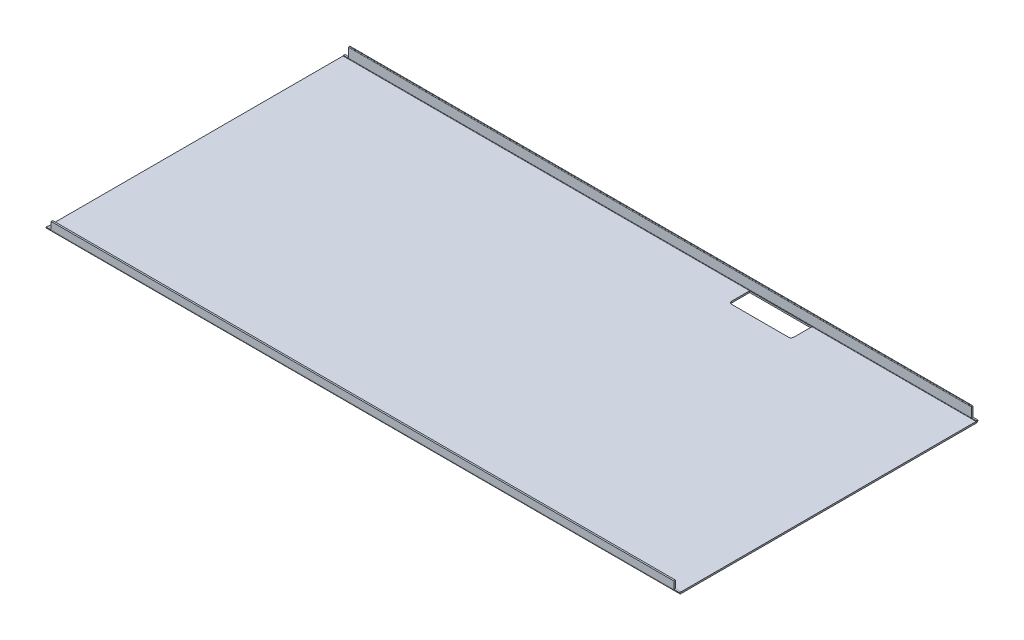
ISO-10303-21;
HEADER;
FILE_DESCRIPTION(('STEP AP214'),'2;1');
FILE_NAME('part.step','',(''),(''),'','','');
FILE_SCHEMA(('AUTOMOTIVE_DESIGN { 1 0 10303 214 1 1 1 1 }'));
ENDSEC;
DATA;
#1=APPLICATION_CONTEXT('core data for automotive mechanical design processes');
#2=APPLICATION_PROTOCOL_DEFINITION('international standard','automotive_design',2000,#1);
#3=PRODUCT_CONTEXT('',#1,'mechanical');
#4=PRODUCT('Part','Part','',(#3));
#5=PRODUCT_RELATED_PRODUCT_CATEGORY('part','',(#4));
#6=PRODUCT_DEFINITION_FORMATION('','',#4);
#7=PRODUCT_DEFINITION_CONTEXT('part definition',#1,'design');
#8=PRODUCT_DEFINITION('design','',#6,#7);
#9=PRODUCT_DEFINITION_SHAPE('','',#8);
#10=(LENGTH_UNIT() NAMED_UNIT(*) SI_UNIT(.MILLI.,.METRE.));
#11=(NAMED_UNIT(*) PLANE_ANGLE_UNIT() SI_UNIT($,.RADIAN.));
#12=(NAMED_UNIT(*) SI_UNIT($,.STERADIAN.) SOLID_ANGLE_UNIT());
#13=UNCERTAINTY_MEASURE_WITH_UNIT(LENGTH_MEASURE(1.E-05),#10,'distance_accuracy_value','');
#14=(GEOMETRIC_REPRESENTATION_CONTEXT(3) GLOBAL_UNCERTAINTY_ASSIGNED_CONTEXT((#13)) GLOBAL_UNIT_ASSIGNED_CONTEXT((#10,
#11,#12)) REPRESENTATION_CONTEXT('',''));
#15=CARTESIAN_POINT('',(0.,0.,0.));
#16=DIRECTION('',(0.,0.,1.));
#17=DIRECTION('',(1.,0.,0.));
#18=AXIS2_PLACEMENT_3D('',#15,#16,#17);
#19=CARTESIAN_POINT('',(1220.,-14.0410958904109,128.030523287671));
#20=DIRECTION('',(1.,0.,0.));
#21=DIRECTION('',(0.,0.,-1.));
#22=AXIS2_PLACEMENT_3D('',#19,#20,#21);
#23=PLANE('',#22);
#24=DIRECTION('',(0.,-1.,0.));
#25=VECTOR('',#24,1.);
#26=CARTESIAN_POINT('',(1220.,-14.0410958904109,128.030523287671));
#27=LINE('',#26,#25);
#28=CARTESIAN_POINT('',(1220.,-14.0410958904109,128.030523287671));
#29=VERTEX_POINT('',#28);
#30=CARTESIAN_POINT('',(1220.,-17.041095890411,128.030523287671));
#31=VERTEX_POINT('',#30);
#32=EDGE_CURVE('E290',#29,#31,#27,.T.);
#33=ORIENTED_EDGE('',*,*,#32,.F.);
#34=CARTESIAN_POINT('',(1220.,-13.3044958904109,128.030523287671));
#35=DIRECTION('',(-1.,0.,0.));
#36=DIRECTION('',(0.,0.,1.));
#37=AXIS2_PLACEMENT_3D('',#34,#35,#36);
#38=CIRCLE('',#37,0.7366);
#39=CARTESIAN_POINT('',(1220.,-13.3044958904109,128.767123287671));
#40=VERTEX_POINT('',#39);
#41=EDGE_CURVE('E373',#40,#29,#38,.F.);
#42=ORIENTED_EDGE('',*,*,#41,.F.);
#43=DIRECTION('',(0.,0.,-1.));
#44=VECTOR('',#43,1.);
#45=CARTESIAN_POINT('',(1220.,-13.3044958904109,131.767123287671));
#46=LINE('',#45,#44);
#47=CARTESIAN_POINT('',(1220.,-13.3044958904109,131.767123287671));
#48=VERTEX_POINT('',#47);
#49=EDGE_CURVE('E288',#48,#40,#46,.T.);
#50=ORIENTED_EDGE('',*,*,#49,.F.);
#51=CARTESIAN_POINT('',(1220.,-13.3044958904109,128.030523287671));
#52=DIRECTION('',(1.,0.,0.));
#53=DIRECTION('',(0.,0.,-1.));
#54=AXIS2_PLACEMENT_3D('',#51,#52,#53);
#55=CIRCLE('',#54,3.7366);
#56=EDGE_CURVE('E376',#48,#31,#55,.T.);
#57=ORIENTED_EDGE('',*,*,#56,.T.);
#58=EDGE_LOOP('',(#33,#42,#50,#57));
#59=FACE_BOUND('',#58,.T.);
#60=ADVANCED_FACE('F41',(#59),#23,.T.);
#61=CARTESIAN_POINT('',(1220.,-13.3044958904109,131.767123287671));
#62=DIRECTION('',(1.,0.,0.));
#63=DIRECTION('',(0.,0.,-1.));
#64=AXIS2_PLACEMENT_3D('',#61,#62,#63);
#65=PLANE('',#64);
#66=DIRECTION('',(0.,0.,-1.));
#67=VECTOR('',#66,1.);
#68=CARTESIAN_POINT('',(1220.,-14.0410958904109,128.767123287671));
#69=LINE('',#68,#67);
#70=CARTESIAN_POINT('',(1220.,-14.0410958904109,-440.496276712329));
#71=VERTEX_POINT('',#70);
#72=EDGE_CURVE('E369',#29,#71,#69,.T.);
#73=ORIENTED_EDGE('',*,*,#72,.F.);
#74=ORIENTED_EDGE('',*,*,#32,.T.);
#75=DIRECTION('',(0.,0.,-1.));
#76=VECTOR('',#75,1.);
#77=CARTESIAN_POINT('',(1220.,-17.041095890411,128.767123287671));
#78=LINE('',#77,#76);
#79=CARTESIAN_POINT('',(1220.,-17.041095890411,-440.496276712329));
#80=VERTEX_POINT('',#79);
#81=EDGE_CURVE('E379',#31,#80,#78,.T.);
#82=ORIENTED_EDGE('',*,*,#81,.T.);
#83=DIRECTION('',(0.,1.,0.));
#84=VECTOR('',#83,1.);
#85=CARTESIAN_POINT('',(1220.,-17.041095890411,-440.496276712329));
#86=LINE('',#85,#84);
#87=EDGE_CURVE('E280',#80,#71,#86,.T.);
#88=ORIENTED_EDGE('',*,*,#87,.T.);
#89=EDGE_LOOP('',(#73,#74,#82,#88));
#90=FACE_BOUND('',#89,.T.);
#91=ADVANCED_FACE('F487',(#90),#65,.T.);
#92=CARTESIAN_POINT('',(0.,-13.3044958904109,128.767123287671));
#93=DIRECTION('',(-1.,0.,0.));
#94=DIRECTION('',(0.,0.,1.));
#95=AXIS2_PLACEMENT_3D('',#92,#93,#94);
#96=PLANE('',#95);
#97=DIRECTION('',(0.,0.,1.));
#98=VECTOR('',#97,1.);
#99=CARTESIAN_POINT('',(0.,-13.3044958904109,128.767123287671));
#100=LINE('',#99,#98);
#101=CARTESIAN_POINT('',(0.,-13.3044958904109,128.767123287671));
#102=VERTEX_POINT('',#101);
#103=CARTESIAN_POINT('',(0.,-13.3044958904109,131.767123287671));
#104=VERTEX_POINT('',#103);
#105=EDGE_CURVE('E286',#102,#104,#100,.T.);
#106=ORIENTED_EDGE('',*,*,#105,.F.);
#107=CARTESIAN_POINT('',(0.,-13.3044958904109,128.030523287671));
#108=DIRECTION('',(-1.,0.,0.));
#109=DIRECTION('',(0.,0.,1.));
#110=AXIS2_PLACEMENT_3D('',#107,#108,#109);
#111=CIRCLE('',#110,0.7366);
#112=CARTESIAN_POINT('',(0.,-14.0410958904109,128.030523287671));
#113=VERTEX_POINT('',#112);
#114=EDGE_CURVE('E389',#102,#113,#111,.F.);
#115=ORIENTED_EDGE('',*,*,#114,.T.);
#116=DIRECTION('',(0.,1.,0.));
#117=VECTOR('',#116,1.);
#118=CARTESIAN_POINT('',(0.,-17.041095890411,128.030523287671));
#119=LINE('',#118,#117);
#120=CARTESIAN_POINT('',(0.,-17.041095890411,128.030523287671));
#121=VERTEX_POINT('',#120);
#122=EDGE_CURVE('E284',#121,#113,#119,.T.);
#123=ORIENTED_EDGE('',*,*,#122,.F.);
#124=CARTESIAN_POINT('',(0.,-13.3044958904109,128.030523287671));
#125=DIRECTION('',(1.,0.,0.));
#126=DIRECTION('',(0.,0.,-1.));
#127=AXIS2_PLACEMENT_3D('',#124,#125,#126);
#128=CIRCLE('',#127,3.7366);
#129=EDGE_CURVE('E392',#104,#121,#128,.T.);
#130=ORIENTED_EDGE('',*,*,#129,.F.);
#131=EDGE_LOOP('',(#106,#115,#123,#130));
#132=FACE_BOUND('',#131,.T.);
#133=ADVANCED_FACE('F474',(#132),#96,.T.);
#134=CARTESIAN_POINT('',(1220.,-13.3044958904109,-441.232876712329));
#135=DIRECTION('',(1.,0.,0.));
#136=DIRECTION('',(0.,0.,-1.));
#137=AXIS2_PLACEMENT_3D('',#134,#135,#136);
#138=PLANE('',#137);
#139=DIRECTION('',(0.,0.,-1.));
#140=VECTOR('',#139,1.);
#141=CARTESIAN_POINT('',(1220.,-13.3044958904109,-441.232876712329));
#142=LINE('',#141,#140);
#143=CARTESIAN_POINT('',(1220.,-13.3044958904109,-441.232876712329));
#144=VERTEX_POINT('',#143);
#145=CARTESIAN_POINT('',(1220.,-13.3044958904109,-444.232876712329));
#146=VERTEX_POINT('',#145);
#147=EDGE_CURVE('E282',#144,#146,#142,.T.);
#148=ORIENTED_EDGE('',*,*,#147,.F.);
#149=CARTESIAN_POINT('',(1220.,-13.3044958904109,-440.496276712329));
#150=DIRECTION('',(-1.,0.,0.));
#151=DIRECTION('',(0.,0.,1.));
#152=AXIS2_PLACEMENT_3D('',#149,#150,#151);
#153=CIRCLE('',#152,0.7366);
#154=EDGE_CURVE('E366',#71,#144,#153,.F.);
#155=ORIENTED_EDGE('',*,*,#154,.F.);
#156=ORIENTED_EDGE('',*,*,#87,.F.);
#157=CARTESIAN_POINT('',(1220.,-13.3044958904109,-440.496276712329));
#158=DIRECTION('',(1.,0.,0.));
#159=DIRECTION('',(0.,0.,-1.));
#160=AXIS2_PLACEMENT_3D('',#157,#158,#159);
#161=CIRCLE('',#160,3.7366);
#162=EDGE_CURVE('E241',#80,#146,#161,.T.);
#163=ORIENTED_EDGE('',*,*,#162,.T.);
#164=EDGE_LOOP('',(#148,#155,#156,#163));
#165=FACE_BOUND('',#164,.T.);
#166=ADVANCED_FACE('F420',(#165),#138,.T.);
#167=CARTESIAN_POINT('',(0.,-14.0410958904109,-440.496276712329));
#168=DIRECTION('',(-1.,0.,0.));
#169=DIRECTION('',(0.,0.,1.));
#170=AXIS2_PLACEMENT_3D('',#167,#168,#169);
#171=PLANE('',#170);
#172=DIRECTION('',(0.,-1.,0.));
#173=VECTOR('',#172,1.);
#174=CARTESIAN_POINT('',(0.,-14.0410958904109,-440.496276712329));
#175=LINE('',#174,#173);
#176=CARTESIAN_POINT('',(0.,-14.0410958904109,-440.496276712329));
#177=VERTEX_POINT('',#176);
#178=CARTESIAN_POINT('',(0.,-17.041095890411,-440.496276712329));
#179=VERTEX_POINT('',#178);
#180=EDGE_CURVE('E277',#177,#179,#175,.T.);
#181=ORIENTED_EDGE('',*,*,#180,.F.);
#182=CARTESIAN_POINT('',(0.,-13.3044958904109,-440.496276712329));
#183=DIRECTION('',(-1.,0.,0.));
#184=DIRECTION('',(0.,0.,1.));
#185=AXIS2_PLACEMENT_3D('',#182,#183,#184);
#186=CIRCLE('',#185,0.7366);
#187=CARTESIAN_POINT('',(0.,-13.3044958904109,-441.232876712329));
#188=VERTEX_POINT('',#187);
#189=EDGE_CURVE('E319',#177,#188,#186,.F.);
#190=ORIENTED_EDGE('',*,*,#189,.T.);
#191=DIRECTION('',(0.,0.,1.));
#192=VECTOR('',#191,1.);
#193=CARTESIAN_POINT('',(0.,-13.3044958904109,-444.232876712329));
#194=LINE('',#193,#192);
#195=CARTESIAN_POINT('',(0.,-13.3044958904109,-444.232876712329));
#196=VERTEX_POINT('',#195);
#197=EDGE_CURVE('E275',#196,#188,#194,.T.);
#198=ORIENTED_EDGE('',*,*,#197,.F.);
#199=CARTESIAN_POINT('',(0.,-13.3044958904109,-440.496276712329));
#200=DIRECTION('',(1.,0.,0.));
#201=DIRECTION('',(0.,0.,-1.));
#202=AXIS2_PLACEMENT_3D('',#199,#200,#201);
#203=CIRCLE('',#202,3.7366);
#204=EDGE_CURVE('E370',#179,#196,#203,.T.);
#205=ORIENTED_EDGE('',*,*,#204,.F.);
#206=EDGE_LOOP('',(#181,#190,#198,#205));
#207=FACE_BOUND('',#206,.T.);
#208=ADVANCED_FACE('F405',(#207),#171,.T.);
#209=CARTESIAN_POINT('',(0.,-13.3044958904109,-444.232876712329));
#210=DIRECTION('',(-1.,0.,0.));
#211=DIRECTION('',(0.,0.,1.));
#212=AXIS2_PLACEMENT_3D('',#209,#210,#211);
#213=PLANE('',#212);
#214=DIRECTION('',(0.,0.,-1.));
#215=VECTOR('',#214,1.);
#216=CARTESIAN_POINT('',(0.,-14.0410958904109,128.767123287671));
#217=LINE('',#216,#215);
#218=EDGE_CURVE('E386',#113,#177,#217,.T.);
#219=ORIENTED_EDGE('',*,*,#218,.T.);
#220=ORIENTED_EDGE('',*,*,#180,.T.);
#221=DIRECTION('',(0.,0.,-1.));
#222=VECTOR('',#221,1.);
#223=CARTESIAN_POINT('',(0.,-17.041095890411,128.767123287671));
#224=LINE('',#223,#222);
#225=EDGE_CURVE('E395',#121,#179,#224,.T.);
#226=ORIENTED_EDGE('',*,*,#225,.F.);
#227=ORIENTED_EDGE('',*,*,#122,.T.);
#228=EDGE_LOOP('',(#219,#220,#226,#227));
#229=FACE_BOUND('',#228,.T.);
#230=ADVANCED_FACE('F464',(#229),#213,.T.);
#231=CARTESIAN_POINT('',(1220.,-14.0410958904109,-444.232876712329));
#232=DIRECTION('',(0.,0.,1.));
#233=DIRECTION('',(1.,0.,0.));
#234=AXIS2_PLACEMENT_3D('',#231,#232,#233);
#235=PLANE('',#234);
#236=DIRECTION('',(0.,-1.,0.));
#237=VECTOR('',#236,1.);
#238=CARTESIAN_POINT('',(10.,5.95890410958905,-444.232876712329));
#239=LINE('',#238,#237);
#240=CARTESIAN_POINT('',(10.,4.95890410958905,-444.232876712329));
#241=VERTEX_POINT('',#240);
#242=CARTESIAN_POINT('',(10.,-13.3044958904109,-444.232876712329));
#243=VERTEX_POINT('',#242);
#244=EDGE_CURVE('E224',#241,#243,#239,.T.);
#245=ORIENTED_EDGE('',*,*,#244,.F.);
#246=DIRECTION('',(-1.,0.,0.));
#247=VECTOR('',#246,1.);
#248=CARTESIAN_POINT('',(1210.,4.95890410958905,-444.232876712329));
#249=LINE('',#248,#247);
#250=CARTESIAN_POINT('',(1210.,4.95890410958905,-444.232876712329));
#251=VERTEX_POINT('',#250);
#252=EDGE_CURVE('E11',#241,#251,#249,.F.);
#253=ORIENTED_EDGE('',*,*,#252,.T.);
#254=DIRECTION('',(0.,1.,0.));
#255=VECTOR('',#254,1.);
#256=CARTESIAN_POINT('',(1210.,5.95890410958905,-444.232876712329));
#257=LINE('',#256,#255);
#258=CARTESIAN_POINT('',(1210.,-13.3044958904109,-444.232876712329));
#259=VERTEX_POINT('',#258);
#260=EDGE_CURVE('E353',#259,#251,#257,.T.);
#261=ORIENTED_EDGE('',*,*,#260,.F.);
#262=DIRECTION('',(-1.,0.,0.));
#263=VECTOR('',#262,1.);
#264=CARTESIAN_POINT('',(1220.,-13.3044958904109,-444.232876712329));
#265=LINE('',#264,#263);
#266=EDGE_CURVE('E383',#259,#243,#265,.T.);
#267=ORIENTED_EDGE('',*,*,#266,.T.);
#268=EDGE_LOOP('',(#245,#253,#261,#267));
#269=FACE_BOUND('',#268,.T.);
#270=ADVANCED_FACE('F421',(#269),#235,.F.);
#271=CARTESIAN_POINT('',(1220.,5.95890410958905,-441.232876712329));
#272=DIRECTION('',(0.,1.,0.));
#273=DIRECTION('',(0.,0.,1.));
#274=AXIS2_PLACEMENT_3D('',#271,#272,#273);
#275=PLANE('',#274);
#276=DIRECTION('',(0.,0.,-1.));
#277=VECTOR('',#276,1.);
#278=CARTESIAN_POINT('',(10.,5.95890410958905,131.767123287671));
#279=LINE('',#278,#277);
#280=CARTESIAN_POINT('',(10.,5.95890410958905,-442.232876712329));
#281=VERTEX_POINT('',#280);
#282=CARTESIAN_POINT('',(10.,5.95890410958905,-443.232876712329));
#283=VERTEX_POINT('',#282);
#284=EDGE_CURVE('E327',#281,#283,#279,.T.);
#285=ORIENTED_EDGE('',*,*,#284,.F.);
#286=DIRECTION('',(-1.,0.,0.));
#287=VECTOR('',#286,1.);
#288=CARTESIAN_POINT('',(1220.,5.95890410958905,-442.232876712329));
#289=LINE('',#288,#287);
#290=CARTESIAN_POINT('',(1210.,5.95890410958905,-442.232876712329));
#291=VERTEX_POINT('',#290);
#292=EDGE_CURVE('E302',#281,#291,#289,.F.);
#293=ORIENTED_EDGE('',*,*,#292,.T.);
#294=DIRECTION('',(0.,0.,-1.));
#295=VECTOR('',#294,1.);
#296=CARTESIAN_POINT('',(1210.,5.95890410958905,131.767123287671));
#297=LINE('',#296,#295);
#298=CARTESIAN_POINT('',(1210.,5.95890410958905,-443.232876712329));
#299=VERTEX_POINT('',#298);
#300=EDGE_CURVE('E309',#291,#299,#297,.T.);
#301=ORIENTED_EDGE('',*,*,#300,.T.);
#302=DIRECTION('',(-1.,0.,0.));
#303=VECTOR('',#302,1.);
#304=CARTESIAN_POINT('',(10.,5.95890410958905,-443.232876712329));
#305=LINE('',#304,#303);
#306=EDGE_CURVE('E299',#299,#283,#305,.T.);
#307=ORIENTED_EDGE('',*,*,#306,.T.);
#308=EDGE_LOOP('',(#285,#293,#301,#307));
#309=FACE_BOUND('',#308,.T.);
#310=ADVANCED_FACE('F331',(#309),#275,.T.);
#311=CARTESIAN_POINT('',(1220.,-14.0410958904109,-441.232876712329));
#312=DIRECTION('',(0.,0.,1.));
#313=DIRECTION('',(1.,0.,0.));
#314=AXIS2_PLACEMENT_3D('',#311,#312,#313);
#315=PLANE('',#314);
#316=DIRECTION('',(0.,-1.,0.));
#317=VECTOR('',#316,1.);
#318=CARTESIAN_POINT('',(1210.,-14.0410958904109,-441.232876712329));
#319=LINE('',#318,#317);
#320=CARTESIAN_POINT('',(1210.,4.95890410958905,-441.232876712329));
#321=VERTEX_POINT('',#320);
#322=CARTESIAN_POINT('',(1210.,-13.3044958904109,-441.232876712329));
#323=VERTEX_POINT('',#322);
#324=EDGE_CURVE('E307',#321,#323,#319,.T.);
#325=ORIENTED_EDGE('',*,*,#324,.F.);
#326=DIRECTION('',(-1.,0.,0.));
#327=VECTOR('',#326,1.);
#328=CARTESIAN_POINT('',(1220.,4.95890410958905,-441.232876712329));
#329=LINE('',#328,#327);
#330=CARTESIAN_POINT('',(10.,4.95890410958905,-441.232876712329));
#331=VERTEX_POINT('',#330);
#332=EDGE_CURVE('E292',#321,#331,#329,.T.);
#333=ORIENTED_EDGE('',*,*,#332,.T.);
#334=DIRECTION('',(0.,1.,0.));
#335=VECTOR('',#334,1.);
#336=CARTESIAN_POINT('',(10.,-14.0410958904115,-441.232876712329));
#337=LINE('',#336,#335);
#338=CARTESIAN_POINT('',(10.,-13.3044958904109,-441.232876712329));
#339=VERTEX_POINT('',#338);
#340=EDGE_CURVE('E329',#339,#331,#337,.T.);
#341=ORIENTED_EDGE('',*,*,#340,.F.);
#342=DIRECTION('',(-1.,0.,0.));
#343=VECTOR('',#342,1.);
#344=CARTESIAN_POINT('',(1220.,-13.3044958904109,-441.232876712329));
#345=LINE('',#344,#343);
#346=EDGE_CURVE('E271',#323,#339,#345,.T.);
#347=ORIENTED_EDGE('',*,*,#346,.F.);
#348=EDGE_LOOP('',(#325,#333,#341,#347));
#349=FACE_BOUND('',#348,.T.);
#350=ADVANCED_FACE('F315',(#349),#315,.T.);
#351=CARTESIAN_POINT('',(1220.,-13.3044958904109,-440.496276712329));
#352=DIRECTION('',(-1.,0.,0.));
#353=DIRECTION('',(0.,0.,1.));
#354=AXIS2_PLACEMENT_3D('',#351,#352,#353);
#355=CYLINDRICAL_SURFACE('',#354,0.7366);
#356=ORIENTED_EDGE('',*,*,#189,.F.);
#357=DIRECTION('',(-1.,0.,0.));
#358=VECTOR('',#357,1.);
#359=CARTESIAN_POINT('',(1220.,-14.0410958904109,-440.496276712329));
#360=LINE('',#359,#358);
#361=CARTESIAN_POINT('',(783.689592113604,-14.0410958904109,-440.496276712329));
#362=VERTEX_POINT('',#361);
#363=EDGE_CURVE('E267',#362,#177,#360,.T.);
#364=ORIENTED_EDGE('',*,*,#363,.F.);
#365=DIRECTION('',(-1.,0.,0.));
#366=VECTOR('',#365,1.);
#367=CARTESIAN_POINT('',(903.689592113604,-14.0410958904109,-440.496276712329));
#368=LINE('',#367,#366);
#369=CARTESIAN_POINT('',(903.689592113604,-14.0410958904109,-440.496276712329));
#370=VERTEX_POINT('',#369);
#371=EDGE_CURVE('E446',#370,#362,#368,.T.);
#372=ORIENTED_EDGE('',*,*,#371,.F.);
#373=EDGE_CURVE('E268',#71,#370,#360,.T.);
#374=ORIENTED_EDGE('',*,*,#373,.F.);
#375=ORIENTED_EDGE('',*,*,#154,.T.);
#376=EDGE_CURVE('E272',#144,#323,#345,.T.);
#377=ORIENTED_EDGE('',*,*,#376,.T.);
#378=ORIENTED_EDGE('',*,*,#346,.T.);
#379=DIRECTION('',(-1.,0.,0.));
#380=VECTOR('',#379,1.);
#381=CARTESIAN_POINT('',(1220.,-13.3044958904109,-441.232876712329));
#382=LINE('',#381,#380);
#383=EDGE_CURVE('E346',#188,#339,#382,.F.);
#384=ORIENTED_EDGE('',*,*,#383,.F.);
#385=EDGE_LOOP('',(#356,#364,#372,#374,#375,#377,#378,#384));
#386=FACE_BOUND('',#385,.T.);
#387=ADVANCED_FACE('F411',(#386),#355,.F.);
#388=CARTESIAN_POINT('',(1220.,-14.0410958904109,128.767123287671));
#389=DIRECTION('',(0.,1.,0.));
#390=DIRECTION('',(0.,0.,1.));
#391=AXIS2_PLACEMENT_3D('',#388,#389,#390);
#392=PLANE('',#391);
#393=DIRECTION('',(0.,0.,-1.));
#394=VECTOR('',#393,1.);
#395=CARTESIAN_POINT('',(903.689592113604,-14.0410958904109,-440.496276712329));
#396=LINE('',#395,#394);
#397=CARTESIAN_POINT('',(903.689592113604,-14.0410958904109,-405.496276712329));
#398=VERTEX_POINT('',#397);
#399=EDGE_CURVE('E210',#398,#370,#396,.T.);
#400=ORIENTED_EDGE('',*,*,#399,.F.);
#401=CARTESIAN_POINT('',(898.689592113604,-14.0410958904109,-405.496276712329));
#402=DIRECTION('',(0.,1.,0.));
#403=DIRECTION('',(0.,0.,1.));
#404=AXIS2_PLACEMENT_3D('',#401,#402,#403);
#405=CIRCLE('',#404,5.);
#406=CARTESIAN_POINT('',(898.689592113604,-14.0410958904109,-400.496276712329));
#407=VERTEX_POINT('',#406);
#408=EDGE_CURVE('E215',#407,#398,#405,.T.);
#409=ORIENTED_EDGE('',*,*,#408,.F.);
#410=DIRECTION('',(1.,0.,0.));
#411=VECTOR('',#410,1.);
#412=CARTESIAN_POINT('',(898.689592113604,-14.0410958904109,-400.496276712329));
#413=LINE('',#412,#411);
#414=CARTESIAN_POINT('',(788.689592113604,-14.0410958904109,-400.496276712329));
#415=VERTEX_POINT('',#414);
#416=EDGE_CURVE('E437',#415,#407,#413,.T.);
#417=ORIENTED_EDGE('',*,*,#416,.F.);
#418=CARTESIAN_POINT('',(788.689592113604,-14.0410958904109,-405.496276712329));
#419=DIRECTION('',(0.,1.,0.));
#420=DIRECTION('',(0.,0.,-1.));
#421=AXIS2_PLACEMENT_3D('',#418,#419,#420);
#422=CIRCLE('',#421,5.00000000000003);
#423=CARTESIAN_POINT('',(783.689592113604,-14.0410958904109,-405.496276712329));
#424=VERTEX_POINT('',#423);
#425=EDGE_CURVE('E440',#424,#415,#422,.T.);
#426=ORIENTED_EDGE('',*,*,#425,.F.);
#427=DIRECTION('',(0.,0.,1.));
#428=VECTOR('',#427,1.);
#429=CARTESIAN_POINT('',(783.689592113604,-14.0410958904109,-440.496276712329));
#430=LINE('',#429,#428);
#431=EDGE_CURVE('E443',#362,#424,#430,.T.);
#432=ORIENTED_EDGE('',*,*,#431,.F.);
#433=ORIENTED_EDGE('',*,*,#363,.T.);
#434=ORIENTED_EDGE('',*,*,#218,.F.);
#435=DIRECTION('',(-1.,0.,0.));
#436=VECTOR('',#435,1.);
#437=CARTESIAN_POINT('',(1220.,-14.0410958904109,128.030523287671));
#438=LINE('',#437,#436);
#439=EDGE_CURVE('E264',#29,#113,#438,.T.);
#440=ORIENTED_EDGE('',*,*,#439,.F.);
#441=ORIENTED_EDGE('',*,*,#72,.T.);
#442=ORIENTED_EDGE('',*,*,#373,.T.);
#443=EDGE_LOOP('',(#400,#409,#417,#426,#432,#433,#434,#440,#441,#442));
#444=FACE_BOUND('',#443,.T.);
#445=ADVANCED_FACE('F468',(#444),#392,.T.);
#446=CARTESIAN_POINT('',(1220.,-13.3044958904109,128.030523287671));
#447=DIRECTION('',(-1.,0.,0.));
#448=DIRECTION('',(0.,0.,1.));
#449=AXIS2_PLACEMENT_3D('',#446,#447,#448);
#450=CYLINDRICAL_SURFACE('',#449,0.7366);
#451=ORIENTED_EDGE('',*,*,#114,.F.);
#452=DIRECTION('',(-1.,0.,0.));
#453=VECTOR('',#452,1.);
#454=CARTESIAN_POINT('',(1220.,-13.3044958904109,128.767123287671));
#455=LINE('',#454,#453);
#456=CARTESIAN_POINT('',(10.,-13.3044958904109,128.767123287671));
#457=VERTEX_POINT('',#456);
#458=EDGE_CURVE('E344',#457,#102,#455,.T.);
#459=ORIENTED_EDGE('',*,*,#458,.F.);
#460=DIRECTION('',(-1.,0.,0.));
#461=VECTOR('',#460,1.);
#462=CARTESIAN_POINT('',(1220.,-13.3044958904109,128.767123287671));
#463=LINE('',#462,#461);
#464=CARTESIAN_POINT('',(1210.,-13.3044958904109,128.767123287671));
#465=VERTEX_POINT('',#464);
#466=EDGE_CURVE('E261',#465,#457,#463,.T.);
#467=ORIENTED_EDGE('',*,*,#466,.F.);
#468=EDGE_CURVE('E262',#40,#465,#463,.T.);
#469=ORIENTED_EDGE('',*,*,#468,.F.);
#470=ORIENTED_EDGE('',*,*,#41,.T.);
#471=ORIENTED_EDGE('',*,*,#439,.T.);
#472=EDGE_LOOP('',(#451,#459,#467,#469,#470,#471));
#473=FACE_BOUND('',#472,.T.);
#474=ADVANCED_FACE('F478',(#473),#450,.F.);
#475=CARTESIAN_POINT('',(1220.,0.958904109589051,128.767123287671));
#476=DIRECTION('',(0.,0.,-1.));
#477=DIRECTION('',(-1.,0.,0.));
#478=AXIS2_PLACEMENT_3D('',#475,#476,#477);
#479=PLANE('',#478);
#480=DIRECTION('',(0.,-1.,0.));
#481=VECTOR('',#480,1.);
#482=CARTESIAN_POINT('',(10.,0.958904109588507,128.767123287671));
#483=LINE('',#482,#481);
#484=CARTESIAN_POINT('',(10.,0.958904109589051,128.767123287671));
#485=VERTEX_POINT('',#484);
#486=EDGE_CURVE('E350',#485,#457,#483,.T.);
#487=ORIENTED_EDGE('',*,*,#486,.F.);
#488=DIRECTION('',(-1.,0.,0.));
#489=VECTOR('',#488,1.);
#490=CARTESIAN_POINT('',(1220.,0.958904109589051,128.767123287671));
#491=LINE('',#490,#489);
#492=CARTESIAN_POINT('',(1210.,0.958904109589051,128.767123287671));
#493=VERTEX_POINT('',#492);
#494=EDGE_CURVE('E258',#493,#485,#491,.T.);
#495=ORIENTED_EDGE('',*,*,#494,.F.);
#496=DIRECTION('',(0.,1.,0.));
#497=VECTOR('',#496,1.);
#498=CARTESIAN_POINT('',(1210.,0.958904109589051,128.767123287671));
#499=LINE('',#498,#497);
#500=EDGE_CURVE('E320',#465,#493,#499,.T.);
#501=ORIENTED_EDGE('',*,*,#500,.F.);
#502=ORIENTED_EDGE('',*,*,#466,.T.);
#503=EDGE_LOOP('',(#487,#495,#501,#502));
#504=FACE_BOUND('',#503,.T.);
#505=ADVANCED_FACE('F555',(#504),#479,.T.);
#506=CARTESIAN_POINT('',(1220.,0.958904109589051,131.767123287671));
#507=DIRECTION('',(0.,1.,0.));
#508=DIRECTION('',(0.,0.,1.));
#509=AXIS2_PLACEMENT_3D('',#506,#507,#508);
#510=PLANE('',#509);
#511=DIRECTION('',(0.,0.,-1.));
#512=VECTOR('',#511,1.);
#513=CARTESIAN_POINT('',(10.,0.958904109589051,131.767123287671));
#514=LINE('',#513,#512);
#515=CARTESIAN_POINT('',(10.,0.958904109589051,131.767123287671));
#516=VERTEX_POINT('',#515);
#517=EDGE_CURVE('E348',#516,#485,#514,.T.);
#518=ORIENTED_EDGE('',*,*,#517,.F.);
#519=DIRECTION('',(-1.,0.,0.));
#520=VECTOR('',#519,1.);
#521=CARTESIAN_POINT('',(1220.,0.958904109589051,131.767123287671));
#522=LINE('',#521,#520);
#523=CARTESIAN_POINT('',(1210.,0.958904109589051,131.767123287671));
#524=VERTEX_POINT('',#523);
#525=EDGE_CURVE('E255',#524,#516,#522,.T.);
#526=ORIENTED_EDGE('',*,*,#525,.F.);
#527=DIRECTION('',(0.,0.,1.));
#528=VECTOR('',#527,1.);
#529=CARTESIAN_POINT('',(1210.,0.958904109589051,131.767123287671));
#530=LINE('',#529,#528);
#531=EDGE_CURVE('E360',#493,#524,#530,.T.);
#532=ORIENTED_EDGE('',*,*,#531,.F.);
#533=ORIENTED_EDGE('',*,*,#494,.T.);
#534=EDGE_LOOP('',(#518,#526,#532,#533));
#535=FACE_BOUND('',#534,.T.);
#536=ADVANCED_FACE('F551',(#535),#510,.T.);
#537=CARTESIAN_POINT('',(1220.,0.958904109589051,131.767123287671));
#538=DIRECTION('',(0.,0.,-1.));
#539=DIRECTION('',(-1.,0.,0.));
#540=AXIS2_PLACEMENT_3D('',#537,#538,#539);
#541=PLANE('',#540);
#542=ORIENTED_EDGE('',*,*,#525,.T.);
#543=DIRECTION('',(0.,-1.,0.));
#544=VECTOR('',#543,1.);
#545=CARTESIAN_POINT('',(10.,5.95890410958905,131.767123287671));
#546=LINE('',#545,#544);
#547=CARTESIAN_POINT('',(10.,-13.3044958904109,131.767123287671));
#548=VERTEX_POINT('',#547);
#549=EDGE_CURVE('E340',#516,#548,#546,.T.);
#550=ORIENTED_EDGE('',*,*,#549,.T.);
#551=DIRECTION('',(-1.,0.,0.));
#552=VECTOR('',#551,1.);
#553=CARTESIAN_POINT('',(1220.,-13.3044958904109,131.767123287671));
#554=LINE('',#553,#552);
#555=CARTESIAN_POINT('',(1210.,-13.3044958904109,131.767123287671));
#556=VERTEX_POINT('',#555);
#557=EDGE_CURVE('E246',#556,#548,#554,.T.);
#558=ORIENTED_EDGE('',*,*,#557,.F.);
#559=DIRECTION('',(0.,1.,0.));
#560=VECTOR('',#559,1.);
#561=CARTESIAN_POINT('',(1210.,5.95890410958905,131.767123287671));
#562=LINE('',#561,#560);
#563=EDGE_CURVE('E354',#556,#524,#562,.T.);
#564=ORIENTED_EDGE('',*,*,#563,.T.);
#565=EDGE_LOOP('',(#542,#550,#558,#564));
#566=FACE_BOUND('',#565,.T.);
#567=ADVANCED_FACE('F547',(#566),#541,.F.);
#568=CARTESIAN_POINT('',(1220.,-13.3044958904109,128.030523287671));
#569=DIRECTION('',(-1.,0.,0.));
#570=DIRECTION('',(0.,0.,1.));
#571=AXIS2_PLACEMENT_3D('',#568,#569,#570);
#572=CYLINDRICAL_SURFACE('',#571,3.7366);
#573=ORIENTED_EDGE('',*,*,#129,.T.);
#574=DIRECTION('',(-1.,0.,0.));
#575=VECTOR('',#574,1.);
#576=CARTESIAN_POINT('',(1220.,-17.041095890411,128.030523287671));
#577=LINE('',#576,#575);
#578=EDGE_CURVE('E242',#31,#121,#577,.T.);
#579=ORIENTED_EDGE('',*,*,#578,.F.);
#580=ORIENTED_EDGE('',*,*,#56,.F.);
#581=EDGE_CURVE('E252',#48,#556,#554,.T.);
#582=ORIENTED_EDGE('',*,*,#581,.T.);
#583=ORIENTED_EDGE('',*,*,#557,.T.);
#584=DIRECTION('',(-1.,0.,0.));
#585=VECTOR('',#584,1.);
#586=CARTESIAN_POINT('',(10.,-13.3044958904109,131.767123287671));
#587=LINE('',#586,#585);
#588=EDGE_CURVE('E334',#548,#104,#587,.T.);
#589=ORIENTED_EDGE('',*,*,#588,.T.);
#590=EDGE_LOOP('',(#573,#579,#580,#582,#583,#589));
#591=FACE_BOUND('',#590,.T.);
#592=ADVANCED_FACE('F544',(#591),#572,.T.);
#593=CARTESIAN_POINT('',(1220.,-17.041095890411,128.767123287671));
#594=DIRECTION('',(0.,1.,0.));
#595=DIRECTION('',(0.,0.,1.));
#596=AXIS2_PLACEMENT_3D('',#593,#594,#595);
#597=PLANE('',#596);
#598=CARTESIAN_POINT('',(898.689592113604,-17.041095890411,-405.496276712329));
#599=DIRECTION('',(0.,1.,0.));
#600=DIRECTION('',(0.,0.,1.));
#601=AXIS2_PLACEMENT_3D('',#598,#599,#600);
#602=CIRCLE('',#601,5.);
#603=CARTESIAN_POINT('',(903.689592113604,-17.041095890411,-405.496276712329));
#604=VERTEX_POINT('',#603);
#605=CARTESIAN_POINT('',(898.689592113604,-17.041095890411,-400.496276712329));
#606=VERTEX_POINT('',#605);
#607=EDGE_CURVE('E235',#604,#606,#602,.F.);
#608=ORIENTED_EDGE('',*,*,#607,.F.);
#609=DIRECTION('',(0.,0.,1.));
#610=VECTOR('',#609,1.);
#611=CARTESIAN_POINT('',(903.689592113604,-17.041095890411,-440.496276712329));
#612=LINE('',#611,#610);
#613=CARTESIAN_POINT('',(903.689592113604,-17.041095890411,-440.496276712329));
#614=VERTEX_POINT('',#613);
#615=EDGE_CURVE('E207',#614,#604,#612,.T.);
#616=ORIENTED_EDGE('',*,*,#615,.F.);
#617=DIRECTION('',(-1.,0.,0.));
#618=VECTOR('',#617,1.);
#619=CARTESIAN_POINT('',(1220.,-17.041095890411,-440.496276712329));
#620=LINE('',#619,#618);
#621=EDGE_CURVE('E231',#80,#614,#620,.T.);
#622=ORIENTED_EDGE('',*,*,#621,.F.);
#623=ORIENTED_EDGE('',*,*,#81,.F.);
#624=ORIENTED_EDGE('',*,*,#578,.T.);
#625=ORIENTED_EDGE('',*,*,#225,.T.);
#626=CARTESIAN_POINT('',(783.689592113604,-17.041095890411,-440.496276712329));
#627=VERTEX_POINT('',#626);
#628=EDGE_CURVE('E243',#627,#179,#620,.T.);
#629=ORIENTED_EDGE('',*,*,#628,.F.);
#630=DIRECTION('',(0.,0.,-1.));
#631=VECTOR('',#630,1.);
#632=CARTESIAN_POINT('',(783.689592113604,-17.041095890411,-440.496276712329));
#633=LINE('',#632,#631);
#634=CARTESIAN_POINT('',(783.689592113604,-17.041095890411,-405.496276712329));
#635=VERTEX_POINT('',#634);
#636=EDGE_CURVE('E456',#635,#627,#633,.T.);
#637=ORIENTED_EDGE('',*,*,#636,.F.);
#638=CARTESIAN_POINT('',(788.689592113604,-17.041095890411,-405.496276712329));
#639=DIRECTION('',(0.,1.,0.));
#640=DIRECTION('',(0.,0.,1.));
#641=AXIS2_PLACEMENT_3D('',#638,#639,#640);
#642=CIRCLE('',#641,5.00000000000003);
#643=CARTESIAN_POINT('',(788.689592113604,-17.041095890411,-400.496276712329));
#644=VERTEX_POINT('',#643);
#645=EDGE_CURVE('E453',#644,#635,#642,.F.);
#646=ORIENTED_EDGE('',*,*,#645,.F.);
#647=DIRECTION('',(-1.,0.,0.));
#648=VECTOR('',#647,1.);
#649=CARTESIAN_POINT('',(898.689592113604,-17.041095890411,-400.496276712329));
#650=LINE('',#649,#648);
#651=EDGE_CURVE('E450',#606,#644,#650,.T.);
#652=ORIENTED_EDGE('',*,*,#651,.F.);
#653=EDGE_LOOP('',(#608,#616,#622,#623,#624,#625,#629,#637,#646,#652));
#654=FACE_BOUND('',#653,.T.);
#655=ADVANCED_FACE('F229',(#654),#597,.F.);
#656=CARTESIAN_POINT('',(1220.,-13.3044958904109,-440.496276712329));
#657=DIRECTION('',(-1.,0.,0.));
#658=DIRECTION('',(0.,0.,1.));
#659=AXIS2_PLACEMENT_3D('',#656,#657,#658);
#660=CYLINDRICAL_SURFACE('',#659,3.7366);
#661=ORIENTED_EDGE('',*,*,#204,.T.);
#662=DIRECTION('',(-1.,0.,0.));
#663=VECTOR('',#662,1.);
#664=CARTESIAN_POINT('',(10.,-13.3044958904109,-444.232876712329));
#665=LINE('',#664,#663);
#666=EDGE_CURVE('E400',#243,#196,#665,.T.);
#667=ORIENTED_EDGE('',*,*,#666,.F.);
#668=ORIENTED_EDGE('',*,*,#266,.F.);
#669=EDGE_CURVE('E248',#146,#259,#265,.T.);
#670=ORIENTED_EDGE('',*,*,#669,.F.);
#671=ORIENTED_EDGE('',*,*,#162,.F.);
#672=ORIENTED_EDGE('',*,*,#621,.T.);
#673=DIRECTION('',(-1.,0.,0.));
#674=VECTOR('',#673,1.);
#675=CARTESIAN_POINT('',(1220.,-17.041095890411,-440.496276712329));
#676=LINE('',#675,#674);
#677=EDGE_CURVE('E219',#627,#614,#676,.F.);
#678=ORIENTED_EDGE('',*,*,#677,.F.);
#679=ORIENTED_EDGE('',*,*,#628,.T.);
#680=EDGE_LOOP('',(#661,#667,#668,#670,#671,#672,#678,#679));
#681=FACE_BOUND('',#680,.T.);
#682=ADVANCED_FACE('F238',(#681),#660,.T.);
#683=CARTESIAN_POINT('',(1210.,-13.3044958904109,131.767123287671));
#684=DIRECTION('',(0.,-1.,0.));
#685=DIRECTION('',(0.,0.,-1.));
#686=AXIS2_PLACEMENT_3D('',#683,#684,#685);
#687=PLANE('',#686);
#688=ORIENTED_EDGE('',*,*,#468,.T.);
#689=DIRECTION('',(0.,0.,-1.));
#690=VECTOR('',#689,1.);
#691=CARTESIAN_POINT('',(1210.,-13.3044958904109,131.767123287671));
#692=LINE('',#691,#690);
#693=EDGE_CURVE('E361',#556,#465,#692,.T.);
#694=ORIENTED_EDGE('',*,*,#693,.F.);
#695=ORIENTED_EDGE('',*,*,#581,.F.);
#696=ORIENTED_EDGE('',*,*,#49,.T.);
#697=EDGE_LOOP('',(#688,#694,#695,#696));
#698=FACE_BOUND('',#697,.T.);
#699=ADVANCED_FACE('F535',(#698),#687,.F.);
#700=CARTESIAN_POINT('',(1210.,5.95890410958905,131.767123287671));
#701=DIRECTION('',(-1.,0.,0.));
#702=DIRECTION('',(0.,0.,1.));
#703=AXIS2_PLACEMENT_3D('',#700,#701,#702);
#704=PLANE('',#703);
#705=ORIENTED_EDGE('',*,*,#500,.T.);
#706=ORIENTED_EDGE('',*,*,#531,.T.);
#707=ORIENTED_EDGE('',*,*,#563,.F.);
#708=ORIENTED_EDGE('',*,*,#693,.T.);
#709=EDGE_LOOP('',(#705,#706,#707,#708));
#710=FACE_BOUND('',#709,.T.);
#711=ADVANCED_FACE('F532',(#710),#704,.F.);
#712=ORIENTED_EDGE('',*,*,#300,.F.);
#713=CARTESIAN_POINT('',(1210.,4.95890410958905,-442.232876712329));
#714=DIRECTION('',(-1.,0.,0.));
#715=DIRECTION('',(0.,0.,1.));
#716=AXIS2_PLACEMENT_3D('',#713,#714,#715);
#717=CIRCLE('',#716,1.);
#718=EDGE_CURVE('E49',#291,#321,#717,.F.);
#719=ORIENTED_EDGE('',*,*,#718,.T.);
#720=ORIENTED_EDGE('',*,*,#324,.T.);
#721=EDGE_CURVE('E357',#323,#259,#692,.T.);
#722=ORIENTED_EDGE('',*,*,#721,.T.);
#723=ORIENTED_EDGE('',*,*,#260,.T.);
#724=CARTESIAN_POINT('',(1210.,4.95890410958905,-443.232876712329));
#725=DIRECTION('',(-1.,0.,0.));
#726=DIRECTION('',(0.,0.,1.));
#727=AXIS2_PLACEMENT_3D('',#724,#725,#726);
#728=CIRCLE('',#727,1.);
#729=EDGE_CURVE('E61',#251,#299,#728,.F.);
#730=ORIENTED_EDGE('',*,*,#729,.T.);
#731=EDGE_LOOP('',(#712,#719,#720,#722,#723,#730));
#732=FACE_BOUND('',#731,.T.);
#733=ADVANCED_FACE('F306',(#732),#704,.F.);
#734=ORIENTED_EDGE('',*,*,#376,.F.);
#735=ORIENTED_EDGE('',*,*,#147,.T.);
#736=ORIENTED_EDGE('',*,*,#669,.T.);
#737=ORIENTED_EDGE('',*,*,#721,.F.);
#738=EDGE_LOOP('',(#734,#735,#736,#737));
#739=FACE_BOUND('',#738,.T.);
#740=ADVANCED_FACE('F417',(#739),#687,.F.);
#741=CARTESIAN_POINT('',(10.,-13.3044958904109,131.767123287671));
#742=DIRECTION('',(0.,-1.,0.));
#743=DIRECTION('',(0.,0.,-1.));
#744=AXIS2_PLACEMENT_3D('',#741,#742,#743);
#745=PLANE('',#744);
#746=ORIENTED_EDGE('',*,*,#383,.T.);
#747=DIRECTION('',(0.,0.,-1.));
#748=VECTOR('',#747,1.);
#749=CARTESIAN_POINT('',(10.,-13.3044958904109,131.767123287671));
#750=LINE('',#749,#748);
#751=EDGE_CURVE('E333',#339,#243,#750,.T.);
#752=ORIENTED_EDGE('',*,*,#751,.T.);
#753=ORIENTED_EDGE('',*,*,#666,.T.);
#754=ORIENTED_EDGE('',*,*,#197,.T.);
#755=EDGE_LOOP('',(#746,#752,#753,#754));
#756=FACE_BOUND('',#755,.T.);
#757=ADVANCED_FACE('F409',(#756),#745,.F.);
#758=CARTESIAN_POINT('',(10.,5.95890410958905,131.767123287671));
#759=DIRECTION('',(1.,0.,0.));
#760=DIRECTION('',(0.,1.,0.));
#761=AXIS2_PLACEMENT_3D('',#758,#759,#760);
#762=PLANE('',#761);
#763=ORIENTED_EDGE('',*,*,#340,.T.);
#764=CARTESIAN_POINT('',(10.,4.95890410958905,-442.232876712329));
#765=DIRECTION('',(1.,0.,0.));
#766=DIRECTION('',(0.,1.,0.));
#767=AXIS2_PLACEMENT_3D('',#764,#765,#766);
#768=CIRCLE('',#767,1.);
#769=EDGE_CURVE('E297',#331,#281,#768,.F.);
#770=ORIENTED_EDGE('',*,*,#769,.T.);
#771=ORIENTED_EDGE('',*,*,#284,.T.);
#772=CARTESIAN_POINT('',(10.,4.95890410958905,-443.232876712329));
#773=DIRECTION('',(1.,0.,0.));
#774=DIRECTION('',(0.,1.,0.));
#775=AXIS2_PLACEMENT_3D('',#772,#773,#774);
#776=CIRCLE('',#775,1.);
#777=EDGE_CURVE('E295',#283,#241,#776,.F.);
#778=ORIENTED_EDGE('',*,*,#777,.T.);
#779=ORIENTED_EDGE('',*,*,#244,.T.);
#780=ORIENTED_EDGE('',*,*,#751,.F.);
#781=EDGE_LOOP('',(#763,#770,#771,#778,#779,#780));
#782=FACE_BOUND('',#781,.T.);
#783=ADVANCED_FACE('F326',(#782),#762,.F.);
#784=ORIENTED_EDGE('',*,*,#458,.T.);
#785=ORIENTED_EDGE('',*,*,#105,.T.);
#786=ORIENTED_EDGE('',*,*,#588,.F.);
#787=EDGE_CURVE('E337',#548,#457,#750,.T.);
#788=ORIENTED_EDGE('',*,*,#787,.T.);
#789=EDGE_LOOP('',(#784,#785,#786,#788));
#790=FACE_BOUND('',#789,.T.);
#791=ADVANCED_FACE('F525',(#790),#745,.F.);
#792=ORIENTED_EDGE('',*,*,#486,.T.);
#793=ORIENTED_EDGE('',*,*,#787,.F.);
#794=ORIENTED_EDGE('',*,*,#549,.F.);
#795=ORIENTED_EDGE('',*,*,#517,.T.);
#796=EDGE_LOOP('',(#792,#793,#794,#795));
#797=FACE_BOUND('',#796,.T.);
#798=ADVANCED_FACE('F504',(#797),#762,.F.);
#799=CARTESIAN_POINT('',(903.689592113604,-17.0420958904109,-440.496276712329));
#800=DIRECTION('',(1.,0.,0.));
#801=DIRECTION('',(0.,0.,-1.));
#802=AXIS2_PLACEMENT_3D('',#799,#800,#801);
#803=PLANE('',#802);
#804=ORIENTED_EDGE('',*,*,#615,.T.);
#805=DIRECTION('',(0.,1.,0.));
#806=VECTOR('',#805,1.);
#807=CARTESIAN_POINT('',(903.689592113604,-17.0420958904109,-405.496276712329));
#808=LINE('',#807,#806);
#809=EDGE_CURVE('E225',#604,#398,#808,.T.);
#810=ORIENTED_EDGE('',*,*,#809,.T.);
#811=ORIENTED_EDGE('',*,*,#399,.T.);
#812=DIRECTION('',(0.,1.,0.));
#813=VECTOR('',#812,1.);
#814=CARTESIAN_POINT('',(903.689592113604,-17.0420958904109,-440.496276712329));
#815=LINE('',#814,#813);
#816=EDGE_CURVE('E203',#614,#370,#815,.T.);
#817=ORIENTED_EDGE('',*,*,#816,.F.);
#818=EDGE_LOOP('',(#804,#810,#811,#817));
#819=FACE_BOUND('',#818,.T.);
#820=ADVANCED_FACE('F205',(#819),#803,.F.);
#821=CARTESIAN_POINT('',(898.689592113604,-17.0420958904109,-405.496276712329));
#822=DIRECTION('',(0.,1.,0.));
#823=DIRECTION('',(0.,0.,1.));
#824=AXIS2_PLACEMENT_3D('',#821,#822,#823);
#825=CYLINDRICAL_SURFACE('',#824,5.);
#826=ORIENTED_EDGE('',*,*,#607,.T.);
#827=DIRECTION('',(0.,1.,0.));
#828=VECTOR('',#827,1.);
#829=CARTESIAN_POINT('',(898.689592113604,-17.0420958904109,-400.496276712329));
#830=LINE('',#829,#828);
#831=EDGE_CURVE('E432',#606,#407,#830,.T.);
#832=ORIENTED_EDGE('',*,*,#831,.T.);
#833=ORIENTED_EDGE('',*,*,#408,.T.);
#834=ORIENTED_EDGE('',*,*,#809,.F.);
#835=EDGE_LOOP('',(#826,#832,#833,#834));
#836=FACE_BOUND('',#835,.T.);
#837=ADVANCED_FACE('F496',(#836),#825,.F.);
#838=CARTESIAN_POINT('',(898.689592113604,-17.0420958904109,-400.496276712329));
#839=DIRECTION('',(0.,0.,1.));
#840=DIRECTION('',(1.,0.,0.));
#841=AXIS2_PLACEMENT_3D('',#838,#839,#840);
#842=PLANE('',#841);
#843=ORIENTED_EDGE('',*,*,#651,.T.);
#844=DIRECTION('',(0.,1.,0.));
#845=VECTOR('',#844,1.);
#846=CARTESIAN_POINT('',(788.689592113604,-17.0420958904109,-400.496276712329));
#847=LINE('',#846,#845);
#848=EDGE_CURVE('E430',#644,#415,#847,.T.);
#849=ORIENTED_EDGE('',*,*,#848,.T.);
#850=ORIENTED_EDGE('',*,*,#416,.T.);
#851=ORIENTED_EDGE('',*,*,#831,.F.);
#852=EDGE_LOOP('',(#843,#849,#850,#851));
#853=FACE_BOUND('',#852,.T.);
#854=ADVANCED_FACE('F494',(#853),#842,.F.);
#855=CARTESIAN_POINT('',(788.689592113604,-17.0420958904109,-405.496276712329));
#856=DIRECTION('',(0.,1.,0.));
#857=DIRECTION('',(0.,0.,1.));
#858=AXIS2_PLACEMENT_3D('',#855,#856,#857);
#859=CYLINDRICAL_SURFACE('',#858,5.00000000000003);
#860=ORIENTED_EDGE('',*,*,#645,.T.);
#861=DIRECTION('',(0.,1.,0.));
#862=VECTOR('',#861,1.);
#863=CARTESIAN_POINT('',(783.689592113604,-17.0420958904109,-405.496276712329));
#864=LINE('',#863,#862);
#865=EDGE_CURVE('E428',#635,#424,#864,.T.);
#866=ORIENTED_EDGE('',*,*,#865,.T.);
#867=ORIENTED_EDGE('',*,*,#425,.T.);
#868=ORIENTED_EDGE('',*,*,#848,.F.);
#869=EDGE_LOOP('',(#860,#866,#867,#868));
#870=FACE_BOUND('',#869,.T.);
#871=ADVANCED_FACE('F492',(#870),#859,.F.);
#872=CARTESIAN_POINT('',(783.689592113604,-17.0420958904109,-440.496276712329));
#873=DIRECTION('',(-1.,0.,0.));
#874=DIRECTION('',(0.,0.,1.));
#875=AXIS2_PLACEMENT_3D('',#872,#873,#874);
#876=PLANE('',#875);
#877=ORIENTED_EDGE('',*,*,#636,.T.);
#878=DIRECTION('',(0.,1.,0.));
#879=VECTOR('',#878,1.);
#880=CARTESIAN_POINT('',(783.689592113604,-17.0420958904109,-440.496276712329));
#881=LINE('',#880,#879);
#882=EDGE_CURVE('E214',#627,#362,#881,.T.);
#883=ORIENTED_EDGE('',*,*,#882,.T.);
#884=ORIENTED_EDGE('',*,*,#431,.T.);
#885=ORIENTED_EDGE('',*,*,#865,.F.);
#886=EDGE_LOOP('',(#877,#883,#884,#885));
#887=FACE_BOUND('',#886,.T.);
#888=ADVANCED_FACE('F459',(#887),#876,.F.);
#889=CARTESIAN_POINT('',(903.689592113604,-17.0420958904109,-440.496276712329));
#890=DIRECTION('',(0.,0.,-1.));
#891=DIRECTION('',(-1.,0.,0.));
#892=AXIS2_PLACEMENT_3D('',#889,#890,#891);
#893=PLANE('',#892);
#894=ORIENTED_EDGE('',*,*,#677,.T.);
#895=ORIENTED_EDGE('',*,*,#816,.T.);
#896=ORIENTED_EDGE('',*,*,#371,.T.);
#897=ORIENTED_EDGE('',*,*,#882,.F.);
#898=EDGE_LOOP('',(#894,#895,#896,#897));
#899=FACE_BOUND('',#898,.T.);
#900=ADVANCED_FACE('F220',(#899),#893,.F.);
#901=CARTESIAN_POINT('',(1220.,4.95890410958905,-442.232876712329));
#902=DIRECTION('',(-1.,0.,0.));
#903=DIRECTION('',(0.,0.,1.));
#904=AXIS2_PLACEMENT_3D('',#901,#902,#903);
#905=CYLINDRICAL_SURFACE('',#904,1.);
#906=ORIENTED_EDGE('',*,*,#718,.F.);
#907=ORIENTED_EDGE('',*,*,#292,.F.);
#908=ORIENTED_EDGE('',*,*,#769,.F.);
#909=ORIENTED_EDGE('',*,*,#332,.F.);
#910=EDGE_LOOP('',(#906,#907,#908,#909));
#911=FACE_BOUND('',#910,.T.);
#912=ADVANCED_FACE('F322',(#911),#905,.T.);
#913=CARTESIAN_POINT('',(1220.,4.95890410958905,-443.232876712329));
#914=DIRECTION('',(1.,0.,0.));
#915=DIRECTION('',(0.,0.,-1.));
#916=AXIS2_PLACEMENT_3D('',#913,#914,#915);
#917=CYLINDRICAL_SURFACE('',#916,1.);
#918=ORIENTED_EDGE('',*,*,#729,.F.);
#919=ORIENTED_EDGE('',*,*,#252,.F.);
#920=ORIENTED_EDGE('',*,*,#777,.F.);
#921=ORIENTED_EDGE('',*,*,#306,.F.);
#922=EDGE_LOOP('',(#918,#919,#920,#921));
#923=FACE_BOUND('',#922,.T.);
#924=ADVANCED_FACE('F43',(#923),#917,.T.);
#925=CLOSED_SHELL('',(#60,#91,#133,#166,#208,#230,#270,#310,#350,#387,#445,#474,#505,#536,#567,
#592,#655,#682,#699,#711,#733,#740,#757,#783,#791,#798,#820,#837,#854,#871,#888,#900,#912,#924));
#926=MANIFOLD_SOLID_BREP('B2',#925);
#927=ADVANCED_BREP_SHAPE_REPRESENTATION('',(#18,#926),#14);
#928=SHAPE_DEFINITION_REPRESENTATION(#9,#927);
ENDSEC;
END-ISO-10303-21;
